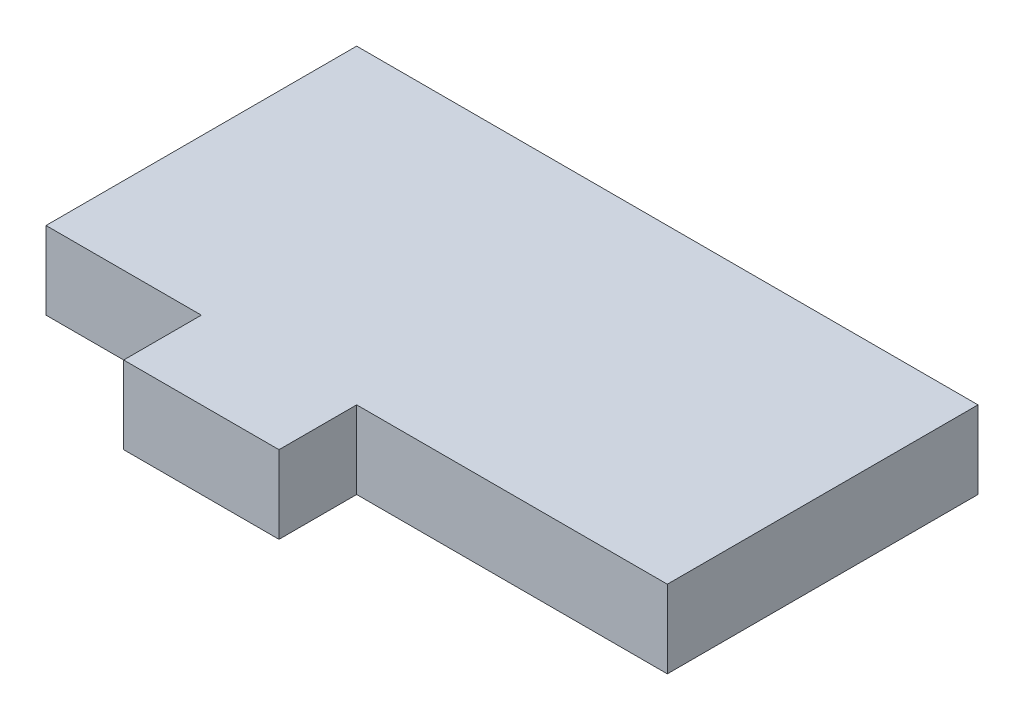
ISO-10303-21;
HEADER;
FILE_DESCRIPTION(('STEP AP214'),'2;1');
FILE_NAME('part.step','',(''),(''),'','','');
FILE_SCHEMA(('AUTOMOTIVE_DESIGN { 1 0 10303 214 1 1 1 1 }'));
ENDSEC;
DATA;
#1=APPLICATION_CONTEXT('core data for automotive mechanical design processes');
#2=APPLICATION_PROTOCOL_DEFINITION('international standard','automotive_design',2000,#1);
#3=PRODUCT_CONTEXT('',#1,'mechanical');
#4=PRODUCT('Part','Part','',(#3));
#5=PRODUCT_RELATED_PRODUCT_CATEGORY('part','',(#4));
#6=PRODUCT_DEFINITION_FORMATION('','',#4);
#7=PRODUCT_DEFINITION_CONTEXT('part definition',#1,'design');
#8=PRODUCT_DEFINITION('design','',#6,#7);
#9=PRODUCT_DEFINITION_SHAPE('','',#8);
#10=(LENGTH_UNIT() NAMED_UNIT(*) SI_UNIT(.MILLI.,.METRE.));
#11=(NAMED_UNIT(*) PLANE_ANGLE_UNIT() SI_UNIT($,.RADIAN.));
#12=(NAMED_UNIT(*) SI_UNIT($,.STERADIAN.) SOLID_ANGLE_UNIT());
#13=UNCERTAINTY_MEASURE_WITH_UNIT(LENGTH_MEASURE(1.E-05),#10,'distance_accuracy_value','');
#14=(GEOMETRIC_REPRESENTATION_CONTEXT(3) GLOBAL_UNCERTAINTY_ASSIGNED_CONTEXT((#13)) GLOBAL_UNIT_ASSIGNED_CONTEXT((#10,
#11,#12)) REPRESENTATION_CONTEXT('',''));
#15=CARTESIAN_POINT('',(0.,0.,0.));
#16=DIRECTION('',(0.,0.,1.));
#17=DIRECTION('',(1.,0.,0.));
#18=AXIS2_PLACEMENT_3D('',#15,#16,#17);
#19=CARTESIAN_POINT('',(25.4,6.35,0.));
#20=DIRECTION('',(1.,0.,0.));
#21=DIRECTION('',(0.,0.,-1.));
#22=AXIS2_PLACEMENT_3D('',#19,#20,#21);
#23=PLANE('',#22);
#24=DIRECTION('',(0.,0.,1.));
#25=VECTOR('',#24,1.);
#26=CARTESIAN_POINT('',(25.4,0.,0.));
#27=LINE('',#26,#25);
#28=CARTESIAN_POINT('',(25.4,0.,0.));
#29=VERTEX_POINT('',#28);
#30=CARTESIAN_POINT('',(25.4,0.,6.35));
#31=VERTEX_POINT('',#30);
#32=EDGE_CURVE('E128',#29,#31,#27,.T.);
#33=ORIENTED_EDGE('',*,*,#32,.F.);
#34=DIRECTION('',(0.,-1.,0.));
#35=VECTOR('',#34,1.);
#36=CARTESIAN_POINT('',(25.4,6.35,0.));
#37=LINE('',#36,#35);
#38=CARTESIAN_POINT('',(25.4,6.35,0.));
#39=VERTEX_POINT('',#38);
#40=EDGE_CURVE('E11',#39,#29,#37,.T.);
#41=ORIENTED_EDGE('',*,*,#40,.F.);
#42=DIRECTION('',(0.,0.,1.));
#43=VECTOR('',#42,1.);
#44=CARTESIAN_POINT('',(25.4,6.35,0.));
#45=LINE('',#44,#43);
#46=CARTESIAN_POINT('',(25.4,6.35,6.35));
#47=VERTEX_POINT('',#46);
#48=EDGE_CURVE('E145',#39,#47,#45,.T.);
#49=ORIENTED_EDGE('',*,*,#48,.T.);
#50=DIRECTION('',(0.,-1.,0.));
#51=VECTOR('',#50,1.);
#52=CARTESIAN_POINT('',(25.4,6.35,6.35));
#53=LINE('',#52,#51);
#54=EDGE_CURVE('E84',#47,#31,#53,.T.);
#55=ORIENTED_EDGE('',*,*,#54,.T.);
#56=EDGE_LOOP('',(#33,#41,#49,#55));
#57=FACE_BOUND('',#56,.T.);
#58=ADVANCED_FACE('F33',(#57),#23,.T.);
#59=CARTESIAN_POINT('',(0.,6.35,0.));
#60=DIRECTION('',(0.,0.,-1.));
#61=DIRECTION('',(-1.,0.,0.));
#62=AXIS2_PLACEMENT_3D('',#59,#60,#61);
#63=PLANE('',#62);
#64=DIRECTION('',(1.,0.,0.));
#65=VECTOR('',#64,1.);
#66=CARTESIAN_POINT('',(0.,0.,0.));
#67=LINE('',#66,#65);
#68=CARTESIAN_POINT('',(50.8,0.,0.));
#69=VERTEX_POINT('',#68);
#70=EDGE_CURVE('E131',#29,#69,#67,.T.);
#71=ORIENTED_EDGE('',*,*,#70,.T.);
#72=DIRECTION('',(0.,-1.,0.));
#73=VECTOR('',#72,1.);
#74=CARTESIAN_POINT('',(50.8,6.35,0.));
#75=LINE('',#74,#73);
#76=CARTESIAN_POINT('',(50.8,6.35,0.));
#77=VERTEX_POINT('',#76);
#78=EDGE_CURVE('E41',#77,#69,#75,.T.);
#79=ORIENTED_EDGE('',*,*,#78,.F.);
#80=DIRECTION('',(1.,0.,0.));
#81=VECTOR('',#80,1.);
#82=CARTESIAN_POINT('',(0.,6.35,0.));
#83=LINE('',#82,#81);
#84=EDGE_CURVE('E114',#39,#77,#83,.T.);
#85=ORIENTED_EDGE('',*,*,#84,.F.);
#86=ORIENTED_EDGE('',*,*,#40,.T.);
#87=EDGE_LOOP('',(#71,#79,#85,#86));
#88=FACE_BOUND('',#87,.T.);
#89=ADVANCED_FACE('F172',(#88),#63,.F.);
#90=CARTESIAN_POINT('',(50.8,6.35,0.));
#91=DIRECTION('',(-1.,0.,0.));
#92=DIRECTION('',(0.,0.,1.));
#93=AXIS2_PLACEMENT_3D('',#90,#91,#92);
#94=PLANE('',#93);
#95=DIRECTION('',(0.,0.,-1.));
#96=VECTOR('',#95,1.);
#97=CARTESIAN_POINT('',(50.8,0.,0.));
#98=LINE('',#97,#96);
#99=CARTESIAN_POINT('',(50.8,0.,-25.4));
#100=VERTEX_POINT('',#99);
#101=EDGE_CURVE('E133',#69,#100,#98,.T.);
#102=ORIENTED_EDGE('',*,*,#101,.T.);
#103=DIRECTION('',(0.,-1.,0.));
#104=VECTOR('',#103,1.);
#105=CARTESIAN_POINT('',(50.8,6.35,-25.4));
#106=LINE('',#105,#104);
#107=CARTESIAN_POINT('',(50.8,6.35,-25.4));
#108=VERTEX_POINT('',#107);
#109=EDGE_CURVE('E151',#108,#100,#106,.T.);
#110=ORIENTED_EDGE('',*,*,#109,.F.);
#111=DIRECTION('',(0.,0.,-1.));
#112=VECTOR('',#111,1.);
#113=CARTESIAN_POINT('',(50.8,6.35,0.));
#114=LINE('',#113,#112);
#115=EDGE_CURVE('E159',#77,#108,#114,.T.);
#116=ORIENTED_EDGE('',*,*,#115,.F.);
#117=ORIENTED_EDGE('',*,*,#78,.T.);
#118=EDGE_LOOP('',(#102,#110,#116,#117));
#119=FACE_BOUND('',#118,.T.);
#120=ADVANCED_FACE('F157',(#119),#94,.F.);
#121=CARTESIAN_POINT('',(0.,6.35,-25.4));
#122=DIRECTION('',(0.,0.,-1.));
#123=DIRECTION('',(-1.,0.,0.));
#124=AXIS2_PLACEMENT_3D('',#121,#122,#123);
#125=PLANE('',#124);
#126=DIRECTION('',(1.,0.,0.));
#127=VECTOR('',#126,1.);
#128=CARTESIAN_POINT('',(0.,0.,-25.4));
#129=LINE('',#128,#127);
#130=CARTESIAN_POINT('',(0.,0.,-25.4));
#131=VERTEX_POINT('',#130);
#132=EDGE_CURVE('E136',#131,#100,#129,.T.);
#133=ORIENTED_EDGE('',*,*,#132,.F.);
#134=DIRECTION('',(0.,-1.,0.));
#135=VECTOR('',#134,1.);
#136=CARTESIAN_POINT('',(0.,6.35,-25.4));
#137=LINE('',#136,#135);
#138=CARTESIAN_POINT('',(0.,6.35,-25.4));
#139=VERTEX_POINT('',#138);
#140=EDGE_CURVE('E149',#139,#131,#137,.T.);
#141=ORIENTED_EDGE('',*,*,#140,.F.);
#142=DIRECTION('',(1.,0.,0.));
#143=VECTOR('',#142,1.);
#144=CARTESIAN_POINT('',(0.,6.35,-25.4));
#145=LINE('',#144,#143);
#146=EDGE_CURVE('E169',#139,#108,#145,.T.);
#147=ORIENTED_EDGE('',*,*,#146,.T.);
#148=ORIENTED_EDGE('',*,*,#109,.T.);
#149=EDGE_LOOP('',(#133,#141,#147,#148));
#150=FACE_BOUND('',#149,.T.);
#151=ADVANCED_FACE('F167',(#150),#125,.T.);
#152=CARTESIAN_POINT('',(0.,6.35,0.));
#153=DIRECTION('',(-1.,0.,0.));
#154=DIRECTION('',(0.,0.,1.));
#155=AXIS2_PLACEMENT_3D('',#152,#153,#154);
#156=PLANE('',#155);
#157=DIRECTION('',(0.,0.,-1.));
#158=VECTOR('',#157,1.);
#159=CARTESIAN_POINT('',(0.,0.,0.));
#160=LINE('',#159,#158);
#161=CARTESIAN_POINT('',(0.,0.,0.));
#162=VERTEX_POINT('',#161);
#163=EDGE_CURVE('E139',#162,#131,#160,.T.);
#164=ORIENTED_EDGE('',*,*,#163,.F.);
#165=DIRECTION('',(0.,-1.,0.));
#166=VECTOR('',#165,1.);
#167=CARTESIAN_POINT('',(0.,6.35,0.));
#168=LINE('',#167,#166);
#169=CARTESIAN_POINT('',(0.,6.35,0.));
#170=VERTEX_POINT('',#169);
#171=EDGE_CURVE('E119',#170,#162,#168,.T.);
#172=ORIENTED_EDGE('',*,*,#171,.F.);
#173=DIRECTION('',(0.,0.,-1.));
#174=VECTOR('',#173,1.);
#175=CARTESIAN_POINT('',(0.,6.35,0.));
#176=LINE('',#175,#174);
#177=EDGE_CURVE('E111',#170,#139,#176,.T.);
#178=ORIENTED_EDGE('',*,*,#177,.T.);
#179=ORIENTED_EDGE('',*,*,#140,.T.);
#180=EDGE_LOOP('',(#164,#172,#178,#179));
#181=FACE_BOUND('',#180,.T.);
#182=ADVANCED_FACE('F182',(#181),#156,.T.);
#183=CARTESIAN_POINT('',(12.7,0.,0.));
#184=VERTEX_POINT('',#183);
#185=EDGE_CURVE('E118',#162,#184,#67,.T.);
#186=ORIENTED_EDGE('',*,*,#185,.T.);
#187=DIRECTION('',(0.,-1.,0.));
#188=VECTOR('',#187,1.);
#189=CARTESIAN_POINT('',(12.7,6.35,0.));
#190=LINE('',#189,#188);
#191=CARTESIAN_POINT('',(12.7,6.35,0.));
#192=VERTEX_POINT('',#191);
#193=EDGE_CURVE('E115',#192,#184,#190,.T.);
#194=ORIENTED_EDGE('',*,*,#193,.F.);
#195=EDGE_CURVE('E104',#170,#192,#83,.T.);
#196=ORIENTED_EDGE('',*,*,#195,.F.);
#197=ORIENTED_EDGE('',*,*,#171,.T.);
#198=EDGE_LOOP('',(#186,#194,#196,#197));
#199=FACE_BOUND('',#198,.T.);
#200=ADVANCED_FACE('F116',(#199),#63,.F.);
#201=CARTESIAN_POINT('',(12.7,6.35,0.));
#202=DIRECTION('',(1.,0.,0.));
#203=DIRECTION('',(0.,0.,-1.));
#204=AXIS2_PLACEMENT_3D('',#201,#202,#203);
#205=PLANE('',#204);
#206=DIRECTION('',(0.,0.,1.));
#207=VECTOR('',#206,1.);
#208=CARTESIAN_POINT('',(12.7,0.,0.));
#209=LINE('',#208,#207);
#210=CARTESIAN_POINT('',(12.7,0.,6.35));
#211=VERTEX_POINT('',#210);
#212=EDGE_CURVE('E77',#184,#211,#209,.T.);
#213=ORIENTED_EDGE('',*,*,#212,.T.);
#214=DIRECTION('',(0.,-1.,0.));
#215=VECTOR('',#214,1.);
#216=CARTESIAN_POINT('',(12.7,6.35,6.35));
#217=LINE('',#216,#215);
#218=CARTESIAN_POINT('',(12.7,6.35,6.35));
#219=VERTEX_POINT('',#218);
#220=EDGE_CURVE('E120',#219,#211,#217,.T.);
#221=ORIENTED_EDGE('',*,*,#220,.F.);
#222=DIRECTION('',(0.,0.,1.));
#223=VECTOR('',#222,1.);
#224=CARTESIAN_POINT('',(12.7,6.35,0.));
#225=LINE('',#224,#223);
#226=EDGE_CURVE('E108',#192,#219,#225,.T.);
#227=ORIENTED_EDGE('',*,*,#226,.F.);
#228=ORIENTED_EDGE('',*,*,#193,.T.);
#229=EDGE_LOOP('',(#213,#221,#227,#228));
#230=FACE_BOUND('',#229,.T.);
#231=ADVANCED_FACE('F122',(#230),#205,.F.);
#232=CARTESIAN_POINT('',(0.,6.35,6.35));
#233=DIRECTION('',(0.,0.,-1.));
#234=DIRECTION('',(-1.,0.,0.));
#235=AXIS2_PLACEMENT_3D('',#232,#233,#234);
#236=PLANE('',#235);
#237=DIRECTION('',(1.,0.,0.));
#238=VECTOR('',#237,1.);
#239=CARTESIAN_POINT('',(0.,0.,6.35));
#240=LINE('',#239,#238);
#241=EDGE_CURVE('E143',#211,#31,#240,.T.);
#242=ORIENTED_EDGE('',*,*,#241,.T.);
#243=ORIENTED_EDGE('',*,*,#54,.F.);
#244=DIRECTION('',(1.,0.,0.));
#245=VECTOR('',#244,1.);
#246=CARTESIAN_POINT('',(0.,6.35,6.35));
#247=LINE('',#246,#245);
#248=EDGE_CURVE('E49',#219,#47,#247,.T.);
#249=ORIENTED_EDGE('',*,*,#248,.F.);
#250=ORIENTED_EDGE('',*,*,#220,.T.);
#251=EDGE_LOOP('',(#242,#243,#249,#250));
#252=FACE_BOUND('',#251,.T.);
#253=ADVANCED_FACE('F187',(#252),#236,.F.);
#254=CARTESIAN_POINT('',(0.,6.35,0.));
#255=DIRECTION('',(0.,1.,0.));
#256=DIRECTION('',(0.,0.,1.));
#257=AXIS2_PLACEMENT_3D('',#254,#255,#256);
#258=PLANE('',#257);
#259=ORIENTED_EDGE('',*,*,#48,.F.);
#260=ORIENTED_EDGE('',*,*,#84,.T.);
#261=ORIENTED_EDGE('',*,*,#115,.T.);
#262=ORIENTED_EDGE('',*,*,#146,.F.);
#263=ORIENTED_EDGE('',*,*,#177,.F.);
#264=ORIENTED_EDGE('',*,*,#195,.T.);
#265=ORIENTED_EDGE('',*,*,#226,.T.);
#266=ORIENTED_EDGE('',*,*,#248,.T.);
#267=EDGE_LOOP('',(#259,#260,#261,#262,#263,#264,#265,#266));
#268=FACE_BOUND('',#267,.T.);
#269=ADVANCED_FACE('F106',(#268),#258,.T.);
#270=CARTESIAN_POINT('',(0.,0.,0.));
#271=DIRECTION('',(0.,1.,0.));
#272=DIRECTION('',(0.,0.,1.));
#273=AXIS2_PLACEMENT_3D('',#270,#271,#272);
#274=PLANE('',#273);
#275=ORIENTED_EDGE('',*,*,#32,.T.);
#276=ORIENTED_EDGE('',*,*,#241,.F.);
#277=ORIENTED_EDGE('',*,*,#212,.F.);
#278=ORIENTED_EDGE('',*,*,#185,.F.);
#279=ORIENTED_EDGE('',*,*,#163,.T.);
#280=ORIENTED_EDGE('',*,*,#132,.T.);
#281=ORIENTED_EDGE('',*,*,#101,.F.);
#282=ORIENTED_EDGE('',*,*,#70,.F.);
#283=EDGE_LOOP('',(#275,#276,#277,#278,#279,#280,#281,#282));
#284=FACE_BOUND('',#283,.T.);
#285=ADVANCED_FACE('F163',(#284),#274,.F.);
#286=CLOSED_SHELL('',(#58,#89,#120,#151,#182,#200,#231,#253,#269,#285));
#287=MANIFOLD_SOLID_BREP('B2',#286);
#288=ADVANCED_BREP_SHAPE_REPRESENTATION('',(#18,#287),#14);
#289=SHAPE_DEFINITION_REPRESENTATION(#9,#288);
ENDSEC;
END-ISO-10303-21;
